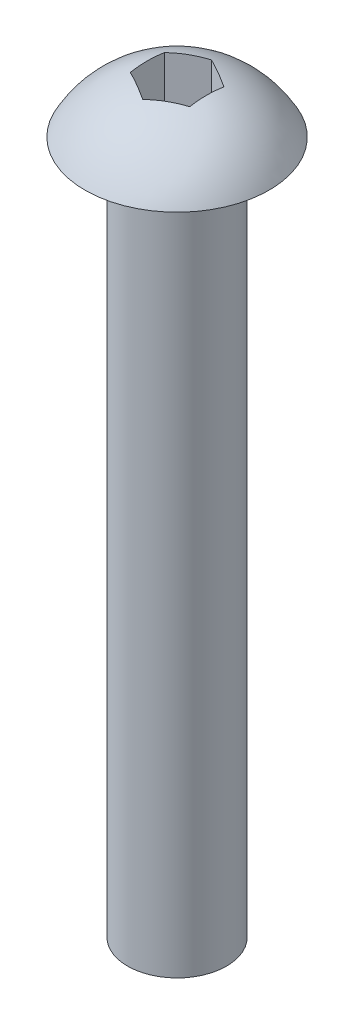
ISO-10303-21;
HEADER;
FILE_DESCRIPTION(('STEP AP214'),'2;1');
FILE_NAME('part.step','',(''),(''),'','','');
FILE_SCHEMA(('AUTOMOTIVE_DESIGN { 1 0 10303 214 1 1 1 1 }'));
ENDSEC;
DATA;
#1=APPLICATION_CONTEXT('core data for automotive mechanical design processes');
#2=APPLICATION_PROTOCOL_DEFINITION('international standard','automotive_design',2000,#1);
#3=PRODUCT_CONTEXT('',#1,'mechanical');
#4=PRODUCT('Part','Part','',(#3));
#5=PRODUCT_RELATED_PRODUCT_CATEGORY('part','',(#4));
#6=PRODUCT_DEFINITION_FORMATION('','',#4);
#7=PRODUCT_DEFINITION_CONTEXT('part definition',#1,'design');
#8=PRODUCT_DEFINITION('design','',#6,#7);
#9=PRODUCT_DEFINITION_SHAPE('','',#8);
#10=(LENGTH_UNIT() NAMED_UNIT(*) SI_UNIT(.MILLI.,.METRE.));
#11=(NAMED_UNIT(*) PLANE_ANGLE_UNIT() SI_UNIT($,.RADIAN.));
#12=(NAMED_UNIT(*) SI_UNIT($,.STERADIAN.) SOLID_ANGLE_UNIT());
#13=UNCERTAINTY_MEASURE_WITH_UNIT(LENGTH_MEASURE(1.E-05),#10,'distance_accuracy_value','');
#14=(GEOMETRIC_REPRESENTATION_CONTEXT(3) GLOBAL_UNCERTAINTY_ASSIGNED_CONTEXT((#13)) GLOBAL_UNIT_ASSIGNED_CONTEXT((#10,
#11,#12)) REPRESENTATION_CONTEXT('',''));
#15=CARTESIAN_POINT('',(0.,0.,0.));
#16=DIRECTION('',(0.,0.,1.));
#17=DIRECTION('',(1.,0.,0.));
#18=AXIS2_PLACEMENT_3D('',#15,#16,#17);
#19=CARTESIAN_POINT('',(0.,-2.46116071428572,0.));
#20=DIRECTION('',(0.,1.,0.));
#21=DIRECTION('',(1.,0.,0.));
#22=AXIS2_PLACEMENT_3D('',#19,#20,#21);
#23=SPHERICAL_SURFACE('',#22,5.26116071428571);
#24=CARTESIAN_POINT('',(0.,0.,0.));
#25=DIRECTION('',(0.,1.,0.));
#26=DIRECTION('',(-1.,0.,0.));
#27=AXIS2_PLACEMENT_3D('',#24,#25,#26);
#28=CIRCLE('',#27,4.65);
#29=CARTESIAN_POINT('',(-4.65,0.,0.));
#30=VERTEX_POINT('',#29);
#31=EDGE_CURVE('E126',#30,#30,#28,.T.);
#32=ORIENTED_EDGE('',*,*,#31,.T.);
#33=EDGE_LOOP('',(#32));
#34=FACE_BOUND('',#33,.T.);
#35=CARTESIAN_POINT('',(0.75,-2.46116071428572,-1.29903810567666));
#36=DIRECTION('',(-0.5,0.,0.866025403784439));
#37=DIRECTION('',(0.866025403784439,0.,0.5));
#38=AXIS2_PLACEMENT_3D('',#35,#36,#37);
#39=CIRCLE('',#38,5.04279803894062);
#40=CARTESIAN_POINT('',(1.5,2.50671730973454,-0.866025403784439));
#41=VERTEX_POINT('',#40);
#42=CARTESIAN_POINT('',(0.,2.50671730973454,-1.73205080756888));
#43=VERTEX_POINT('',#42);
#44=EDGE_CURVE('E11',#41,#43,#39,.T.);
#45=ORIENTED_EDGE('',*,*,#44,.F.);
#46=CARTESIAN_POINT('',(1.5,-2.46116071428572,0.));
#47=DIRECTION('',(-1.,0.,0.));
#48=DIRECTION('',(0.,0.,1.));
#49=AXIS2_PLACEMENT_3D('',#46,#47,#48);
#50=CIRCLE('',#49,5.04279803894062);
#51=CARTESIAN_POINT('',(1.5,2.50671730973454,0.866025403784439));
#52=VERTEX_POINT('',#51);
#53=EDGE_CURVE('E129',#52,#41,#50,.T.);
#54=ORIENTED_EDGE('',*,*,#53,.F.);
#55=CARTESIAN_POINT('',(0.75,-2.46116071428572,1.29903810567666));
#56=DIRECTION('',(-0.5,0.,-0.866025403784439));
#57=DIRECTION('',(-0.866025403784439,0.,0.5));
#58=AXIS2_PLACEMENT_3D('',#55,#56,#57);
#59=CIRCLE('',#58,5.04279803894062);
#60=CARTESIAN_POINT('',(0.,2.50671730973454,1.73205080756888));
#61=VERTEX_POINT('',#60);
#62=EDGE_CURVE('E131',#61,#52,#59,.T.);
#63=ORIENTED_EDGE('',*,*,#62,.F.);
#64=CARTESIAN_POINT('',(-0.750000000000001,-2.46116071428572,1.29903810567666));
#65=DIRECTION('',(0.5,0.,-0.866025403784439));
#66=DIRECTION('',(-0.866025403784439,0.,-0.5));
#67=AXIS2_PLACEMENT_3D('',#64,#65,#66);
#68=CIRCLE('',#67,5.04279803894062);
#69=CARTESIAN_POINT('',(-1.5,2.50671730973454,0.866025403784439));
#70=VERTEX_POINT('',#69);
#71=EDGE_CURVE('E133',#70,#61,#68,.T.);
#72=ORIENTED_EDGE('',*,*,#71,.F.);
#73=CARTESIAN_POINT('',(-1.5,-2.46116071428572,0.));
#74=DIRECTION('',(1.,0.,0.));
#75=DIRECTION('',(0.,0.,-1.));
#76=AXIS2_PLACEMENT_3D('',#73,#74,#75);
#77=CIRCLE('',#76,5.04279803894062);
#78=CARTESIAN_POINT('',(-1.5,2.50671730973454,-0.866025403784439));
#79=VERTEX_POINT('',#78);
#80=EDGE_CURVE('E135',#79,#70,#77,.T.);
#81=ORIENTED_EDGE('',*,*,#80,.F.);
#82=CARTESIAN_POINT('',(-0.75,-2.46116071428572,-1.29903810567666));
#83=DIRECTION('',(0.5,0.,0.866025403784439));
#84=DIRECTION('',(0.866025403784439,0.,-0.5));
#85=AXIS2_PLACEMENT_3D('',#82,#83,#84);
#86=CIRCLE('',#85,5.04279803894062);
#87=EDGE_CURVE('E39',#43,#79,#86,.T.);
#88=ORIENTED_EDGE('',*,*,#87,.F.);
#89=EDGE_LOOP('',(#45,#54,#63,#72,#81,#88));
#90=FACE_BOUND('',#89,.T.);
#91=ADVANCED_FACE('F32',(#34,#90),#23,.T.);
#92=CARTESIAN_POINT('',(2.5,0.,0.));
#93=DIRECTION('',(0.,1.,0.));
#94=DIRECTION('',(-1.,0.,0.));
#95=AXIS2_PLACEMENT_3D('',#92,#93,#94);
#96=PLANE('',#95);
#97=ORIENTED_EDGE('',*,*,#31,.F.);
#98=EDGE_LOOP('',(#97));
#99=FACE_BOUND('',#98,.T.);
#100=CARTESIAN_POINT('',(0.,0.,0.));
#101=DIRECTION('',(0.,1.,0.));
#102=DIRECTION('',(-1.,0.,0.));
#103=AXIS2_PLACEMENT_3D('',#100,#101,#102);
#104=CIRCLE('',#103,2.5);
#105=CARTESIAN_POINT('',(-2.5,0.,0.));
#106=VERTEX_POINT('',#105);
#107=EDGE_CURVE('E123',#106,#106,#104,.T.);
#108=ORIENTED_EDGE('',*,*,#107,.T.);
#109=EDGE_LOOP('',(#108));
#110=FACE_BOUND('',#109,.T.);
#111=ADVANCED_FACE('F161',(#99,#110),#96,.F.);
#112=CARTESIAN_POINT('',(0.,0.,0.));
#113=DIRECTION('',(0.,1.,0.));
#114=DIRECTION('',(-1.,0.,0.));
#115=AXIS2_PLACEMENT_3D('',#112,#113,#114);
#116=CYLINDRICAL_SURFACE('',#115,2.5);
#117=ORIENTED_EDGE('',*,*,#107,.F.);
#118=EDGE_LOOP('',(#117));
#119=FACE_BOUND('',#118,.T.);
#120=CARTESIAN_POINT('',(0.,-35.,0.));
#121=DIRECTION('',(0.,1.,0.));
#122=DIRECTION('',(-1.,0.,0.));
#123=AXIS2_PLACEMENT_3D('',#120,#121,#122);
#124=CIRCLE('',#123,2.5);
#125=CARTESIAN_POINT('',(-2.49999999999999,-35.,0.));
#126=VERTEX_POINT('',#125);
#127=EDGE_CURVE('E88',#126,#126,#124,.T.);
#128=ORIENTED_EDGE('',*,*,#127,.T.);
#129=EDGE_LOOP('',(#128));
#130=FACE_BOUND('',#129,.T.);
#131=ADVANCED_FACE('F166',(#119,#130),#116,.T.);
#132=CARTESIAN_POINT('',(0.,-35.,0.));
#133=DIRECTION('',(0.,1.,0.));
#134=DIRECTION('',(-1.,0.,0.));
#135=AXIS2_PLACEMENT_3D('',#132,#133,#134);
#136=PLANE('',#135);
#137=ORIENTED_EDGE('',*,*,#127,.F.);
#138=EDGE_LOOP('',(#137));
#139=FACE_BOUND('',#138,.T.);
#140=ADVANCED_FACE('F174',(#139),#136,.F.);
#141=CARTESIAN_POINT('',(1.5,10.,-0.866025403784439));
#142=DIRECTION('',(-0.5,0.,0.866025403784439));
#143=DIRECTION('',(0.866025403784439,0.,0.5));
#144=AXIS2_PLACEMENT_3D('',#141,#142,#143);
#145=PLANE('',#144);
#146=ORIENTED_EDGE('',*,*,#44,.T.);
#147=DIRECTION('',(0.,-1.,0.));
#148=VECTOR('',#147,1.);
#149=CARTESIAN_POINT('',(0.,10.,-1.73205080756888));
#150=LINE('',#149,#148);
#151=CARTESIAN_POINT('',(0.,0.,-1.73205080756888));
#152=VERTEX_POINT('',#151);
#153=EDGE_CURVE('E81',#43,#152,#150,.T.);
#154=ORIENTED_EDGE('',*,*,#153,.T.);
#155=DIRECTION('',(-0.866025403784439,0.,-0.5));
#156=VECTOR('',#155,1.);
#157=CARTESIAN_POINT('',(1.5,0.,-0.866025403784439));
#158=LINE('',#157,#156);
#159=CARTESIAN_POINT('',(1.5,0.,-0.866025403784439));
#160=VERTEX_POINT('',#159);
#161=EDGE_CURVE('E85',#160,#152,#158,.T.);
#162=ORIENTED_EDGE('',*,*,#161,.F.);
#163=DIRECTION('',(0.,-1.,0.));
#164=VECTOR('',#163,1.);
#165=CARTESIAN_POINT('',(1.5,10.,-0.866025403784439));
#166=LINE('',#165,#164);
#167=EDGE_CURVE('E113',#41,#160,#166,.T.);
#168=ORIENTED_EDGE('',*,*,#167,.F.);
#169=EDGE_LOOP('',(#146,#154,#162,#168));
#170=FACE_BOUND('',#169,.T.);
#171=ADVANCED_FACE('F83',(#170),#145,.T.);
#172=CARTESIAN_POINT('',(0.,10.,-1.73205080756888));
#173=DIRECTION('',(0.5,0.,0.866025403784439));
#174=DIRECTION('',(0.866025403784439,0.,-0.5));
#175=AXIS2_PLACEMENT_3D('',#172,#173,#174);
#176=PLANE('',#175);
#177=ORIENTED_EDGE('',*,*,#87,.T.);
#178=DIRECTION('',(0.,-1.,0.));
#179=VECTOR('',#178,1.);
#180=CARTESIAN_POINT('',(-1.5,10.,-0.866025403784439));
#181=LINE('',#180,#179);
#182=CARTESIAN_POINT('',(-1.5,0.,-0.866025403784439));
#183=VERTEX_POINT('',#182);
#184=EDGE_CURVE('E89',#79,#183,#181,.T.);
#185=ORIENTED_EDGE('',*,*,#184,.T.);
#186=DIRECTION('',(-0.866025403784439,0.,0.5));
#187=VECTOR('',#186,1.);
#188=CARTESIAN_POINT('',(0.,0.,-1.73205080756888));
#189=LINE('',#188,#187);
#190=EDGE_CURVE('E92',#152,#183,#189,.T.);
#191=ORIENTED_EDGE('',*,*,#190,.F.);
#192=ORIENTED_EDGE('',*,*,#153,.F.);
#193=EDGE_LOOP('',(#177,#185,#191,#192));
#194=FACE_BOUND('',#193,.T.);
#195=ADVANCED_FACE('F93',(#194),#176,.T.);
#196=CARTESIAN_POINT('',(-1.5,10.,-0.866025403784439));
#197=DIRECTION('',(1.,0.,0.));
#198=DIRECTION('',(0.,0.,-1.));
#199=AXIS2_PLACEMENT_3D('',#196,#197,#198);
#200=PLANE('',#199);
#201=ORIENTED_EDGE('',*,*,#80,.T.);
#202=DIRECTION('',(0.,-1.,0.));
#203=VECTOR('',#202,1.);
#204=CARTESIAN_POINT('',(-1.5,10.,0.866025403784439));
#205=LINE('',#204,#203);
#206=CARTESIAN_POINT('',(-1.5,0.,0.866025403784439));
#207=VERTEX_POINT('',#206);
#208=EDGE_CURVE('E118',#70,#207,#205,.T.);
#209=ORIENTED_EDGE('',*,*,#208,.T.);
#210=DIRECTION('',(0.,0.,1.));
#211=VECTOR('',#210,1.);
#212=CARTESIAN_POINT('',(-1.5,0.,-0.866025403784439));
#213=LINE('',#212,#211);
#214=EDGE_CURVE('E98',#183,#207,#213,.T.);
#215=ORIENTED_EDGE('',*,*,#214,.F.);
#216=ORIENTED_EDGE('',*,*,#184,.F.);
#217=EDGE_LOOP('',(#201,#209,#215,#216));
#218=FACE_BOUND('',#217,.T.);
#219=ADVANCED_FACE('F139',(#218),#200,.T.);
#220=CARTESIAN_POINT('',(-1.5,10.,0.866025403784439));
#221=DIRECTION('',(0.5,0.,-0.866025403784439));
#222=DIRECTION('',(-0.866025403784439,0.,-0.5));
#223=AXIS2_PLACEMENT_3D('',#220,#221,#222);
#224=PLANE('',#223);
#225=ORIENTED_EDGE('',*,*,#71,.T.);
#226=DIRECTION('',(0.,-1.,0.));
#227=VECTOR('',#226,1.);
#228=CARTESIAN_POINT('',(0.,10.,1.73205080756888));
#229=LINE('',#228,#227);
#230=CARTESIAN_POINT('',(0.,0.,1.73205080756888));
#231=VERTEX_POINT('',#230);
#232=EDGE_CURVE('E116',#61,#231,#229,.T.);
#233=ORIENTED_EDGE('',*,*,#232,.T.);
#234=DIRECTION('',(0.866025403784438,0.,0.5));
#235=VECTOR('',#234,1.);
#236=CARTESIAN_POINT('',(-1.5,0.,0.866025403784439));
#237=LINE('',#236,#235);
#238=EDGE_CURVE('E107',#207,#231,#237,.T.);
#239=ORIENTED_EDGE('',*,*,#238,.F.);
#240=ORIENTED_EDGE('',*,*,#208,.F.);
#241=EDGE_LOOP('',(#225,#233,#239,#240));
#242=FACE_BOUND('',#241,.T.);
#243=ADVANCED_FACE('F146',(#242),#224,.T.);
#244=CARTESIAN_POINT('',(0.,10.,1.73205080756888));
#245=DIRECTION('',(-0.5,0.,-0.866025403784439));
#246=DIRECTION('',(-0.866025403784439,0.,0.5));
#247=AXIS2_PLACEMENT_3D('',#244,#245,#246);
#248=PLANE('',#247);
#249=ORIENTED_EDGE('',*,*,#62,.T.);
#250=DIRECTION('',(0.,-1.,0.));
#251=VECTOR('',#250,1.);
#252=CARTESIAN_POINT('',(1.5,10.,0.866025403784439));
#253=LINE('',#252,#251);
#254=CARTESIAN_POINT('',(1.5,0.,0.866025403784439));
#255=VERTEX_POINT('',#254);
#256=EDGE_CURVE('E46',#52,#255,#253,.T.);
#257=ORIENTED_EDGE('',*,*,#256,.T.);
#258=DIRECTION('',(0.866025403784439,0.,-0.5));
#259=VECTOR('',#258,1.);
#260=CARTESIAN_POINT('',(0.,0.,1.73205080756888));
#261=LINE('',#260,#259);
#262=EDGE_CURVE('E110',#231,#255,#261,.T.);
#263=ORIENTED_EDGE('',*,*,#262,.F.);
#264=ORIENTED_EDGE('',*,*,#232,.F.);
#265=EDGE_LOOP('',(#249,#257,#263,#264));
#266=FACE_BOUND('',#265,.T.);
#267=ADVANCED_FACE('F150',(#266),#248,.T.);
#268=CARTESIAN_POINT('',(1.5,10.,0.866025403784439));
#269=DIRECTION('',(-1.,0.,0.));
#270=DIRECTION('',(0.,0.,1.));
#271=AXIS2_PLACEMENT_3D('',#268,#269,#270);
#272=PLANE('',#271);
#273=ORIENTED_EDGE('',*,*,#53,.T.);
#274=ORIENTED_EDGE('',*,*,#167,.T.);
#275=DIRECTION('',(0.,0.,-1.));
#276=VECTOR('',#275,1.);
#277=CARTESIAN_POINT('',(1.5,0.,0.866025403784439));
#278=LINE('',#277,#276);
#279=EDGE_CURVE('E103',#255,#160,#278,.T.);
#280=ORIENTED_EDGE('',*,*,#279,.F.);
#281=ORIENTED_EDGE('',*,*,#256,.F.);
#282=EDGE_LOOP('',(#273,#274,#280,#281));
#283=FACE_BOUND('',#282,.T.);
#284=ADVANCED_FACE('F151',(#283),#272,.T.);
#285=CARTESIAN_POINT('',(0.,0.,0.));
#286=DIRECTION('',(0.,1.,0.));
#287=DIRECTION('',(0.,0.,1.));
#288=AXIS2_PLACEMENT_3D('',#285,#286,#287);
#289=PLANE('',#288);
#290=ORIENTED_EDGE('',*,*,#161,.T.);
#291=ORIENTED_EDGE('',*,*,#190,.T.);
#292=ORIENTED_EDGE('',*,*,#214,.T.);
#293=ORIENTED_EDGE('',*,*,#238,.T.);
#294=ORIENTED_EDGE('',*,*,#262,.T.);
#295=ORIENTED_EDGE('',*,*,#279,.T.);
#296=EDGE_LOOP('',(#290,#291,#292,#293,#294,#295));
#297=FACE_BOUND('',#296,.T.);
#298=ADVANCED_FACE('F101',(#297),#289,.T.);
#299=CLOSED_SHELL('',(#91,#111,#131,#140,#171,#195,#219,#243,#267,#284,#298));
#300=MANIFOLD_SOLID_BREP('B2',#299);
#301=ADVANCED_BREP_SHAPE_REPRESENTATION('',(#18,#300),#14);
#302=SHAPE_DEFINITION_REPRESENTATION(#9,#301);
ENDSEC;
END-ISO-10303-21;
